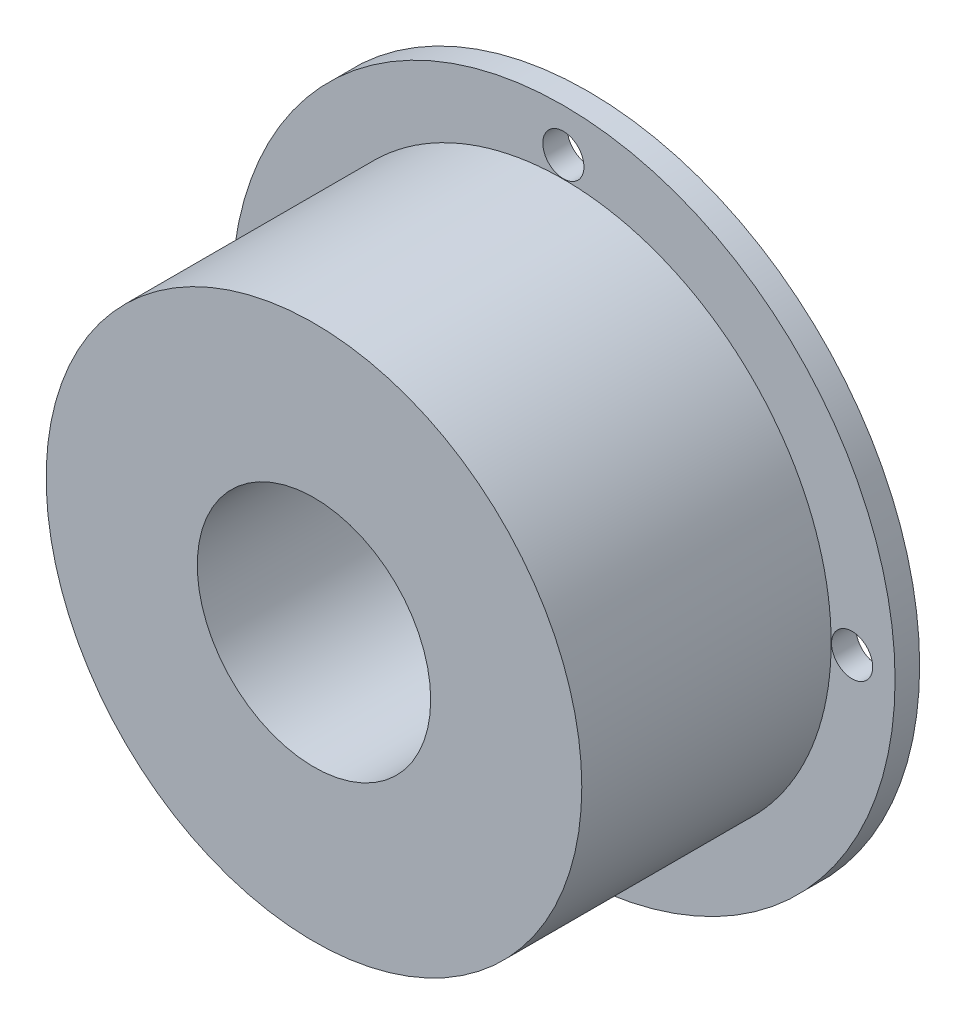
ISO-10303-21;
HEADER;
FILE_DESCRIPTION(('STEP AP214'),'2;1');
FILE_NAME('part.step','',(''),(''),'','','');
FILE_SCHEMA(('AUTOMOTIVE_DESIGN { 1 0 10303 214 1 1 1 1 }'));
ENDSEC;
DATA;
#1=APPLICATION_CONTEXT('core data for automotive mechanical design processes');
#2=APPLICATION_PROTOCOL_DEFINITION('international standard','automotive_design',2000,#1);
#3=PRODUCT_CONTEXT('',#1,'mechanical');
#4=PRODUCT('Part','Part','',(#3));
#5=PRODUCT_RELATED_PRODUCT_CATEGORY('part','',(#4));
#6=PRODUCT_DEFINITION_FORMATION('','',#4);
#7=PRODUCT_DEFINITION_CONTEXT('part definition',#1,'design');
#8=PRODUCT_DEFINITION('design','',#6,#7);
#9=PRODUCT_DEFINITION_SHAPE('','',#8);
#10=(LENGTH_UNIT() NAMED_UNIT(*) SI_UNIT(.MILLI.,.METRE.));
#11=(NAMED_UNIT(*) PLANE_ANGLE_UNIT() SI_UNIT($,.RADIAN.));
#12=(NAMED_UNIT(*) SI_UNIT($,.STERADIAN.) SOLID_ANGLE_UNIT());
#13=UNCERTAINTY_MEASURE_WITH_UNIT(LENGTH_MEASURE(1.E-05),#10,'distance_accuracy_value','');
#14=(GEOMETRIC_REPRESENTATION_CONTEXT(3) GLOBAL_UNCERTAINTY_ASSIGNED_CONTEXT((#13)) GLOBAL_UNIT_ASSIGNED_CONTEXT((#10,
#11,#12)) REPRESENTATION_CONTEXT('',''));
#15=CARTESIAN_POINT('',(0.,0.,0.));
#16=DIRECTION('',(0.,0.,1.));
#17=DIRECTION('',(1.,0.,0.));
#18=AXIS2_PLACEMENT_3D('',#15,#16,#17);
#19=CARTESIAN_POINT('',(0.,0.,2.));
#20=DIRECTION('',(0.,0.,-1.));
#21=DIRECTION('',(-1.,0.,0.));
#22=AXIS2_PLACEMENT_3D('',#19,#20,#21);
#23=CYLINDRICAL_SURFACE('',#22,27.);
#24=CARTESIAN_POINT('',(0.,0.,2.));
#25=DIRECTION('',(0.,0.,-1.));
#26=DIRECTION('',(-1.,0.,0.));
#27=AXIS2_PLACEMENT_3D('',#24,#25,#26);
#28=CIRCLE('',#27,27.);
#29=CARTESIAN_POINT('',(-27.,0.,2.));
#30=VERTEX_POINT('',#29);
#31=EDGE_CURVE('E11',#30,#30,#28,.T.);
#32=ORIENTED_EDGE('',*,*,#31,.T.);
#33=EDGE_LOOP('',(#32));
#34=FACE_BOUND('',#33,.T.);
#35=CARTESIAN_POINT('',(0.,0.,0.));
#36=DIRECTION('',(0.,0.,-1.));
#37=DIRECTION('',(-1.,0.,0.));
#38=AXIS2_PLACEMENT_3D('',#35,#36,#37);
#39=CIRCLE('',#38,27.);
#40=CARTESIAN_POINT('',(-27.,0.,0.));
#41=VERTEX_POINT('',#40);
#42=EDGE_CURVE('E42',#41,#41,#39,.T.);
#43=ORIENTED_EDGE('',*,*,#42,.F.);
#44=EDGE_LOOP('',(#43));
#45=FACE_BOUND('',#44,.T.);
#46=ADVANCED_FACE('F39',(#34,#45),#23,.T.);
#47=CARTESIAN_POINT('',(0.,0.,2.));
#48=DIRECTION('',(0.,0.,-1.));
#49=DIRECTION('',(-1.,0.,0.));
#50=AXIS2_PLACEMENT_3D('',#47,#48,#49);
#51=PLANE('',#50);
#52=CARTESIAN_POINT('',(23.5,0.,2.));
#53=DIRECTION('',(0.,0.,-1.));
#54=DIRECTION('',(-1.,0.,0.));
#55=AXIS2_PLACEMENT_3D('',#52,#53,#54);
#56=CIRCLE('',#55,1.675);
#57=CARTESIAN_POINT('',(21.825,0.,2.));
#58=VERTEX_POINT('',#57);
#59=EDGE_CURVE('E72',#58,#58,#56,.T.);
#60=ORIENTED_EDGE('',*,*,#59,.T.);
#61=EDGE_LOOP('',(#60));
#62=FACE_BOUND('',#61,.T.);
#63=CARTESIAN_POINT('',(-23.5,0.,2.));
#64=DIRECTION('',(0.,0.,-1.));
#65=DIRECTION('',(-1.,0.,0.));
#66=AXIS2_PLACEMENT_3D('',#63,#64,#65);
#67=CIRCLE('',#66,1.675);
#68=CARTESIAN_POINT('',(-25.175,0.,2.));
#69=VERTEX_POINT('',#68);
#70=EDGE_CURVE('E66',#69,#69,#67,.T.);
#71=ORIENTED_EDGE('',*,*,#70,.T.);
#72=EDGE_LOOP('',(#71));
#73=FACE_BOUND('',#72,.T.);
#74=CARTESIAN_POINT('',(0.,-23.5,2.));
#75=DIRECTION('',(0.,0.,-1.));
#76=DIRECTION('',(-1.,0.,0.));
#77=AXIS2_PLACEMENT_3D('',#74,#75,#76);
#78=CIRCLE('',#77,1.675);
#79=CARTESIAN_POINT('',(-1.67500000000001,-23.5,2.));
#80=VERTEX_POINT('',#79);
#81=EDGE_CURVE('E60',#80,#80,#78,.T.);
#82=ORIENTED_EDGE('',*,*,#81,.T.);
#83=EDGE_LOOP('',(#82));
#84=FACE_BOUND('',#83,.T.);
#85=CARTESIAN_POINT('',(0.,23.5,2.));
#86=DIRECTION('',(0.,0.,-1.));
#87=DIRECTION('',(-1.,0.,0.));
#88=AXIS2_PLACEMENT_3D('',#85,#86,#87);
#89=CIRCLE('',#88,1.675);
#90=CARTESIAN_POINT('',(-1.675,23.5,2.));
#91=VERTEX_POINT('',#90);
#92=EDGE_CURVE('E54',#91,#91,#89,.T.);
#93=ORIENTED_EDGE('',*,*,#92,.T.);
#94=EDGE_LOOP('',(#93));
#95=FACE_BOUND('',#94,.T.);
#96=CARTESIAN_POINT('',(0.,0.,2.));
#97=DIRECTION('',(0.,0.,-1.));
#98=DIRECTION('',(-1.,0.,0.));
#99=AXIS2_PLACEMENT_3D('',#96,#97,#98);
#100=CIRCLE('',#99,21.8);
#101=CARTESIAN_POINT('',(-21.8,0.,2.));
#102=VERTEX_POINT('',#101);
#103=EDGE_CURVE('E49',#102,#102,#100,.T.);
#104=ORIENTED_EDGE('',*,*,#103,.T.);
#105=EDGE_LOOP('',(#104));
#106=FACE_BOUND('',#105,.T.);
#107=ORIENTED_EDGE('',*,*,#31,.F.);
#108=EDGE_LOOP('',(#107));
#109=FACE_BOUND('',#108,.T.);
#110=ADVANCED_FACE('F81',(#62,#73,#84,#95,#106,#109),#51,.F.);
#111=CARTESIAN_POINT('',(0.,0.,0.));
#112=DIRECTION('',(0.,0.,-1.));
#113=DIRECTION('',(-1.,0.,0.));
#114=AXIS2_PLACEMENT_3D('',#111,#112,#113);
#115=PLANE('',#114);
#116=CARTESIAN_POINT('',(23.5,0.,0.));
#117=DIRECTION('',(0.,0.,-1.));
#118=DIRECTION('',(-1.,0.,0.));
#119=AXIS2_PLACEMENT_3D('',#116,#117,#118);
#120=CIRCLE('',#119,1.675);
#121=CARTESIAN_POINT('',(21.825,0.,0.));
#122=VERTEX_POINT('',#121);
#123=EDGE_CURVE('E75',#122,#122,#120,.T.);
#124=ORIENTED_EDGE('',*,*,#123,.F.);
#125=EDGE_LOOP('',(#124));
#126=FACE_BOUND('',#125,.T.);
#127=CARTESIAN_POINT('',(-23.5,0.,0.));
#128=DIRECTION('',(0.,0.,-1.));
#129=DIRECTION('',(-1.,0.,0.));
#130=AXIS2_PLACEMENT_3D('',#127,#128,#129);
#131=CIRCLE('',#130,1.675);
#132=CARTESIAN_POINT('',(-25.175,0.,0.));
#133=VERTEX_POINT('',#132);
#134=EDGE_CURVE('E69',#133,#133,#131,.T.);
#135=ORIENTED_EDGE('',*,*,#134,.F.);
#136=EDGE_LOOP('',(#135));
#137=FACE_BOUND('',#136,.T.);
#138=CARTESIAN_POINT('',(0.,-23.5,0.));
#139=DIRECTION('',(0.,0.,-1.));
#140=DIRECTION('',(-1.,0.,0.));
#141=AXIS2_PLACEMENT_3D('',#138,#139,#140);
#142=CIRCLE('',#141,1.675);
#143=CARTESIAN_POINT('',(-1.67500000000001,-23.5,0.));
#144=VERTEX_POINT('',#143);
#145=EDGE_CURVE('E63',#144,#144,#142,.T.);
#146=ORIENTED_EDGE('',*,*,#145,.F.);
#147=EDGE_LOOP('',(#146));
#148=FACE_BOUND('',#147,.T.);
#149=CARTESIAN_POINT('',(0.,23.5,0.));
#150=DIRECTION('',(0.,0.,-1.));
#151=DIRECTION('',(-1.,0.,0.));
#152=AXIS2_PLACEMENT_3D('',#149,#150,#151);
#153=CIRCLE('',#152,1.675);
#154=CARTESIAN_POINT('',(-1.675,23.5,0.));
#155=VERTEX_POINT('',#154);
#156=EDGE_CURVE('E57',#155,#155,#153,.T.);
#157=ORIENTED_EDGE('',*,*,#156,.F.);
#158=EDGE_LOOP('',(#157));
#159=FACE_BOUND('',#158,.T.);
#160=CARTESIAN_POINT('',(0.,0.,0.));
#161=DIRECTION('',(0.,0.,-1.));
#162=DIRECTION('',(-1.,0.,0.));
#163=AXIS2_PLACEMENT_3D('',#160,#161,#162);
#164=CIRCLE('',#163,21.8);
#165=CARTESIAN_POINT('',(-21.8,0.,0.));
#166=VERTEX_POINT('',#165);
#167=EDGE_CURVE('E51',#166,#166,#164,.T.);
#168=ORIENTED_EDGE('',*,*,#167,.F.);
#169=EDGE_LOOP('',(#168));
#170=FACE_BOUND('',#169,.T.);
#171=ORIENTED_EDGE('',*,*,#42,.T.);
#172=EDGE_LOOP('',(#171));
#173=FACE_BOUND('',#172,.T.);
#174=ADVANCED_FACE('F91',(#126,#137,#148,#159,#170,#173),#115,.T.);
#175=CARTESIAN_POINT('',(0.,0.,2.));
#176=DIRECTION('',(0.,0.,-1.));
#177=DIRECTION('',(-1.,0.,0.));
#178=AXIS2_PLACEMENT_3D('',#175,#176,#177);
#179=CYLINDRICAL_SURFACE('',#178,21.8);
#180=ORIENTED_EDGE('',*,*,#103,.F.);
#181=EDGE_LOOP('',(#180));
#182=FACE_BOUND('',#181,.T.);
#183=ORIENTED_EDGE('',*,*,#167,.T.);
#184=EDGE_LOOP('',(#183));
#185=FACE_BOUND('',#184,.T.);
#186=ADVANCED_FACE('F94',(#182,#185),#179,.F.);
#187=CARTESIAN_POINT('',(0.,23.5,2.));
#188=DIRECTION('',(0.,0.,-1.));
#189=DIRECTION('',(-1.,0.,0.));
#190=AXIS2_PLACEMENT_3D('',#187,#188,#189);
#191=CYLINDRICAL_SURFACE('',#190,1.675);
#192=ORIENTED_EDGE('',*,*,#92,.F.);
#193=EDGE_LOOP('',(#192));
#194=FACE_BOUND('',#193,.T.);
#195=ORIENTED_EDGE('',*,*,#156,.T.);
#196=EDGE_LOOP('',(#195));
#197=FACE_BOUND('',#196,.T.);
#198=ADVANCED_FACE('F115',(#194,#197),#191,.F.);
#199=CARTESIAN_POINT('',(0.,-23.5,2.));
#200=DIRECTION('',(0.,0.,-1.));
#201=DIRECTION('',(-1.,0.,0.));
#202=AXIS2_PLACEMENT_3D('',#199,#200,#201);
#203=CYLINDRICAL_SURFACE('',#202,1.675);
#204=ORIENTED_EDGE('',*,*,#81,.F.);
#205=EDGE_LOOP('',(#204));
#206=FACE_BOUND('',#205,.T.);
#207=ORIENTED_EDGE('',*,*,#145,.T.);
#208=EDGE_LOOP('',(#207));
#209=FACE_BOUND('',#208,.T.);
#210=ADVANCED_FACE('F119',(#206,#209),#203,.F.);
#211=CARTESIAN_POINT('',(-23.5,0.,2.));
#212=DIRECTION('',(0.,0.,-1.));
#213=DIRECTION('',(-1.,0.,0.));
#214=AXIS2_PLACEMENT_3D('',#211,#212,#213);
#215=CYLINDRICAL_SURFACE('',#214,1.675);
#216=ORIENTED_EDGE('',*,*,#70,.F.);
#217=EDGE_LOOP('',(#216));
#218=FACE_BOUND('',#217,.T.);
#219=ORIENTED_EDGE('',*,*,#134,.T.);
#220=EDGE_LOOP('',(#219));
#221=FACE_BOUND('',#220,.T.);
#222=ADVANCED_FACE('F87',(#218,#221),#215,.F.);
#223=CARTESIAN_POINT('',(23.5,0.,2.));
#224=DIRECTION('',(0.,0.,-1.));
#225=DIRECTION('',(-1.,0.,0.));
#226=AXIS2_PLACEMENT_3D('',#223,#224,#225);
#227=CYLINDRICAL_SURFACE('',#226,1.675);
#228=ORIENTED_EDGE('',*,*,#59,.F.);
#229=EDGE_LOOP('',(#228));
#230=FACE_BOUND('',#229,.T.);
#231=ORIENTED_EDGE('',*,*,#123,.T.);
#232=EDGE_LOOP('',(#231));
#233=FACE_BOUND('',#232,.T.);
#234=ADVANCED_FACE('F84',(#230,#233),#227,.F.);
#235=CLOSED_SHELL('',(#46,#110,#174,#186,#198,#210,#222,#234));
#236=MANIFOLD_SOLID_BREP('B2',#235);
#237=CARTESIAN_POINT('',(0.,0.,22.3));
#238=DIRECTION('',(0.,0.,1.));
#239=DIRECTION('',(1.,0.,0.));
#240=AXIS2_PLACEMENT_3D('',#237,#238,#239);
#241=PLANE('',#240);
#242=CARTESIAN_POINT('',(0.,0.,22.3));
#243=DIRECTION('',(0.,0.,1.));
#244=DIRECTION('',(1.,0.,0.));
#245=AXIS2_PLACEMENT_3D('',#242,#243,#244);
#246=CIRCLE('',#245,21.8);
#247=CARTESIAN_POINT('',(21.8,0.,22.3));
#248=VERTEX_POINT('',#247);
#249=EDGE_CURVE('E38',#248,#248,#246,.T.);
#250=ORIENTED_EDGE('',*,*,#249,.T.);
#251=EDGE_LOOP('',(#250));
#252=FACE_BOUND('',#251,.T.);
#253=CARTESIAN_POINT('',(0.,0.,22.3));
#254=DIRECTION('',(0.,0.,1.));
#255=DIRECTION('',(1.,0.,0.));
#256=AXIS2_PLACEMENT_3D('',#253,#254,#255);
#257=CIRCLE('',#256,9.5);
#258=CARTESIAN_POINT('',(9.5,0.,22.3));
#259=VERTEX_POINT('',#258);
#260=EDGE_CURVE('E196',#259,#259,#257,.T.);
#261=ORIENTED_EDGE('',*,*,#260,.F.);
#262=EDGE_LOOP('',(#261));
#263=FACE_BOUND('',#262,.T.);
#264=ADVANCED_FACE('F185',(#252,#263),#241,.T.);
#265=CARTESIAN_POINT('',(0.,0.,0.));
#266=DIRECTION('',(0.,0.,1.));
#267=DIRECTION('',(1.,0.,0.));
#268=AXIS2_PLACEMENT_3D('',#265,#266,#267);
#269=PLANE('',#268);
#270=CARTESIAN_POINT('',(0.,0.,0.));
#271=DIRECTION('',(0.,0.,1.));
#272=DIRECTION('',(1.,0.,0.));
#273=AXIS2_PLACEMENT_3D('',#270,#271,#272);
#274=CIRCLE('',#273,21.8);
#275=CARTESIAN_POINT('',(21.8,0.,0.));
#276=VERTEX_POINT('',#275);
#277=EDGE_CURVE('E189',#276,#276,#274,.T.);
#278=ORIENTED_EDGE('',*,*,#277,.F.);
#279=EDGE_LOOP('',(#278));
#280=FACE_BOUND('',#279,.T.);
#281=CARTESIAN_POINT('',(0.,0.,0.));
#282=DIRECTION('',(0.,0.,1.));
#283=DIRECTION('',(1.,0.,0.));
#284=AXIS2_PLACEMENT_3D('',#281,#282,#283);
#285=CIRCLE('',#284,9.5);
#286=CARTESIAN_POINT('',(9.5,0.,0.));
#287=VERTEX_POINT('',#286);
#288=EDGE_CURVE('E198',#287,#287,#285,.T.);
#289=ORIENTED_EDGE('',*,*,#288,.T.);
#290=EDGE_LOOP('',(#289));
#291=FACE_BOUND('',#290,.T.);
#292=ADVANCED_FACE('F208',(#280,#291),#269,.F.);
#293=CARTESIAN_POINT('',(0.,0.,22.3));
#294=DIRECTION('',(0.,0.,-1.));
#295=DIRECTION('',(-1.,0.,0.));
#296=AXIS2_PLACEMENT_3D('',#293,#294,#295);
#297=CYLINDRICAL_SURFACE('',#296,21.8);
#298=ORIENTED_EDGE('',*,*,#249,.F.);
#299=EDGE_LOOP('',(#298));
#300=FACE_BOUND('',#299,.T.);
#301=ORIENTED_EDGE('',*,*,#277,.T.);
#302=EDGE_LOOP('',(#301));
#303=FACE_BOUND('',#302,.T.);
#304=ADVANCED_FACE('F187',(#300,#303),#297,.T.);
#305=CARTESIAN_POINT('',(0.,0.,22.3));
#306=DIRECTION('',(0.,0.,-1.));
#307=DIRECTION('',(-1.,0.,0.));
#308=AXIS2_PLACEMENT_3D('',#305,#306,#307);
#309=CYLINDRICAL_SURFACE('',#308,9.5);
#310=ORIENTED_EDGE('',*,*,#260,.T.);
#311=EDGE_LOOP('',(#310));
#312=FACE_BOUND('',#311,.T.);
#313=ORIENTED_EDGE('',*,*,#288,.F.);
#314=EDGE_LOOP('',(#313));
#315=FACE_BOUND('',#314,.T.);
#316=ADVANCED_FACE('F204',(#312,#315),#309,.F.);
#317=CLOSED_SHELL('',(#264,#292,#304,#316));
#318=MANIFOLD_SOLID_BREP('B6',#317);
#319=ADVANCED_BREP_SHAPE_REPRESENTATION('',(#18,#236,#318),#14);
#320=SHAPE_DEFINITION_REPRESENTATION(#9,#319);
ENDSEC;
END-ISO-10303-21;
